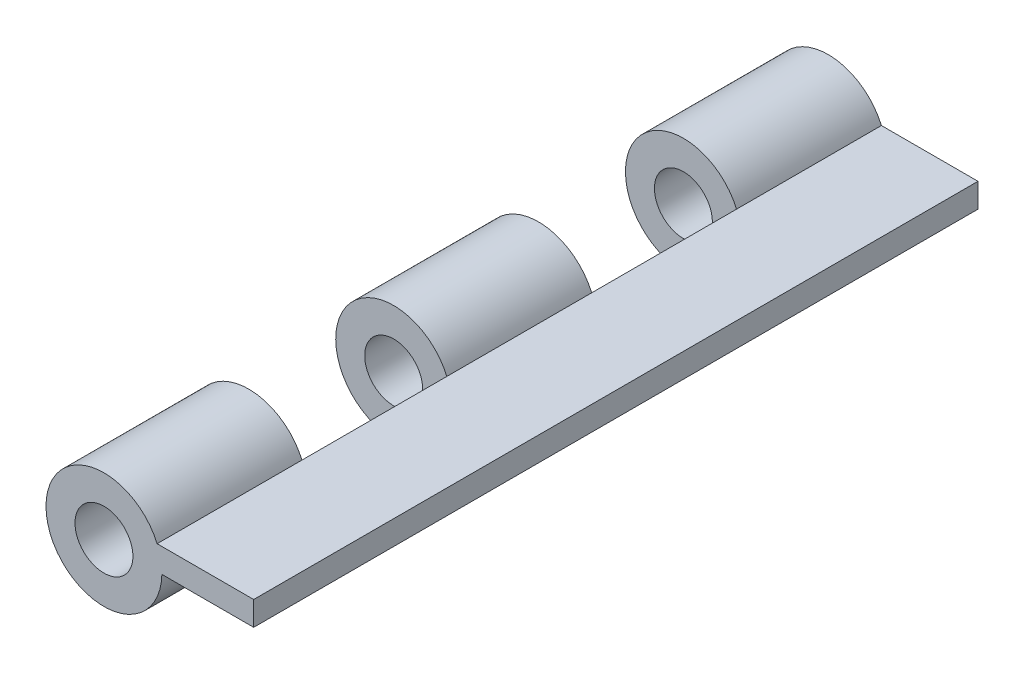
ISO-10303-21;
HEADER;
FILE_DESCRIPTION(('STEP AP214'),'2;1');
FILE_NAME('part.step','',(''),(''),'','','');
FILE_SCHEMA(('AUTOMOTIVE_DESIGN { 1 0 10303 214 1 1 1 1 }'));
ENDSEC;
DATA;
#1=APPLICATION_CONTEXT('core data for automotive mechanical design processes');
#2=APPLICATION_PROTOCOL_DEFINITION('international standard','automotive_design',2000,#1);
#3=PRODUCT_CONTEXT('',#1,'mechanical');
#4=PRODUCT('Part','Part','',(#3));
#5=PRODUCT_RELATED_PRODUCT_CATEGORY('part','',(#4));
#6=PRODUCT_DEFINITION_FORMATION('','',#4);
#7=PRODUCT_DEFINITION_CONTEXT('part definition',#1,'design');
#8=PRODUCT_DEFINITION('design','',#6,#7);
#9=PRODUCT_DEFINITION_SHAPE('','',#8);
#10=(LENGTH_UNIT() NAMED_UNIT(*) SI_UNIT(.MILLI.,.METRE.));
#11=(NAMED_UNIT(*) PLANE_ANGLE_UNIT() SI_UNIT($,.RADIAN.));
#12=(NAMED_UNIT(*) SI_UNIT($,.STERADIAN.) SOLID_ANGLE_UNIT());
#13=UNCERTAINTY_MEASURE_WITH_UNIT(LENGTH_MEASURE(1.E-05),#10,'distance_accuracy_value','');
#14=(GEOMETRIC_REPRESENTATION_CONTEXT(3) GLOBAL_UNCERTAINTY_ASSIGNED_CONTEXT((#13)) GLOBAL_UNIT_ASSIGNED_CONTEXT((#10,
#11,#12)) REPRESENTATION_CONTEXT('',''));
#15=CARTESIAN_POINT('',(0.,0.,0.));
#16=DIRECTION('',(0.,0.,1.));
#17=DIRECTION('',(1.,0.,0.));
#18=AXIS2_PLACEMENT_3D('',#15,#16,#17);
#19=CARTESIAN_POINT('',(-10.,2.5,75.0000000000001));
#20=DIRECTION('',(1.,0.,0.));
#21=DIRECTION('',(0.,0.,-1.));
#22=AXIS2_PLACEMENT_3D('',#19,#20,#21);
#23=PLANE('',#22);
#24=DIRECTION('',(0.,0.,1.));
#25=VECTOR('',#24,1.);
#26=CARTESIAN_POINT('',(-10.,2.5,75.0000000000001));
#27=LINE('',#26,#25);
#28=CARTESIAN_POINT('',(-10.,2.5,-44.9999999999999));
#29=VERTEX_POINT('',#28);
#30=CARTESIAN_POINT('',(-10.,2.5,-14.9999999999999));
#31=VERTEX_POINT('',#30);
#32=EDGE_CURVE('E174',#29,#31,#27,.T.);
#33=ORIENTED_EDGE('',*,*,#32,.F.);
#34=DIRECTION('',(0.,-1.,0.));
#35=VECTOR('',#34,1.);
#36=CARTESIAN_POINT('',(-10.,2.5,-44.9999999999999));
#37=LINE('',#36,#35);
#38=CARTESIAN_POINT('',(-10.,-2.5,-44.9999999999999));
#39=VERTEX_POINT('',#38);
#40=EDGE_CURVE('E117',#29,#39,#37,.T.);
#41=ORIENTED_EDGE('',*,*,#40,.T.);
#42=DIRECTION('',(0.,0.,1.));
#43=VECTOR('',#42,1.);
#44=CARTESIAN_POINT('',(-10.,-2.5,75.0000000000001));
#45=LINE('',#44,#43);
#46=CARTESIAN_POINT('',(-10.,-2.5,-14.9999999999999));
#47=VERTEX_POINT('',#46);
#48=EDGE_CURVE('E129',#39,#47,#45,.T.);
#49=ORIENTED_EDGE('',*,*,#48,.T.);
#50=DIRECTION('',(0.,-1.,0.));
#51=VECTOR('',#50,1.);
#52=CARTESIAN_POINT('',(-10.,2.5,-14.9999999999999));
#53=LINE('',#52,#51);
#54=EDGE_CURVE('E146',#31,#47,#53,.T.);
#55=ORIENTED_EDGE('',*,*,#54,.F.);
#56=EDGE_LOOP('',(#33,#41,#49,#55));
#57=FACE_BOUND('',#56,.T.);
#58=ADVANCED_FACE('F34',(#57),#23,.F.);
#59=CARTESIAN_POINT('',(0.,-2.5,0.));
#60=DIRECTION('',(0.,1.,0.));
#61=DIRECTION('',(0.,0.,1.));
#62=AXIS2_PLACEMENT_3D('',#59,#60,#61);
#63=PLANE('',#62);
#64=DIRECTION('',(1.,0.,0.));
#65=VECTOR('',#64,1.);
#66=CARTESIAN_POINT('',(0.,-2.5,-44.9999999999999));
#67=LINE('',#66,#65);
#68=CARTESIAN_POINT('',(-9.01178484052324,-2.5,-44.9999999999999));
#69=VERTEX_POINT('',#68);
#70=EDGE_CURVE('E121',#39,#69,#67,.T.);
#71=ORIENTED_EDGE('',*,*,#70,.T.);
#72=DIRECTION('',(0.,0.,1.));
#73=VECTOR('',#72,1.);
#74=CARTESIAN_POINT('',(-9.01178484052324,-2.5,-74.9999999999999));
#75=LINE('',#74,#73);
#76=CARTESIAN_POINT('',(-9.01178484052324,-2.5,-74.9999999999999));
#77=VERTEX_POINT('',#76);
#78=EDGE_CURVE('E108',#69,#77,#75,.F.);
#79=ORIENTED_EDGE('',*,*,#78,.T.);
#80=DIRECTION('',(-1.,0.,0.));
#81=VECTOR('',#80,1.);
#82=CARTESIAN_POINT('',(10.,-2.5,-74.9999999999999));
#83=LINE('',#82,#81);
#84=CARTESIAN_POINT('',(10.,-2.5,-74.9999999999999));
#85=VERTEX_POINT('',#84);
#86=EDGE_CURVE('E188',#85,#77,#83,.T.);
#87=ORIENTED_EDGE('',*,*,#86,.F.);
#88=DIRECTION('',(0.,0.,-1.));
#89=VECTOR('',#88,1.);
#90=CARTESIAN_POINT('',(10.,-2.5,75.0000000000001));
#91=LINE('',#90,#89);
#92=CARTESIAN_POINT('',(10.,-2.5,75.0000000000001));
#93=VERTEX_POINT('',#92);
#94=EDGE_CURVE('E186',#93,#85,#91,.T.);
#95=ORIENTED_EDGE('',*,*,#94,.F.);
#96=DIRECTION('',(1.,0.,0.));
#97=VECTOR('',#96,1.);
#98=CARTESIAN_POINT('',(10.,-2.5,75.0000000000001));
#99=LINE('',#98,#97);
#100=CARTESIAN_POINT('',(-9.01178484052324,-2.5,75.0000000000001));
#101=VERTEX_POINT('',#100);
#102=EDGE_CURVE('E184',#101,#93,#99,.T.);
#103=ORIENTED_EDGE('',*,*,#102,.F.);
#104=DIRECTION('',(0.,0.,1.));
#105=VECTOR('',#104,1.);
#106=CARTESIAN_POINT('',(-9.01178484052324,-2.5,45.0000000000001));
#107=LINE('',#106,#105);
#108=CARTESIAN_POINT('',(-9.01178484052324,-2.5,45.0000000000001));
#109=VERTEX_POINT('',#108);
#110=EDGE_CURVE('E197',#101,#109,#107,.F.);
#111=ORIENTED_EDGE('',*,*,#110,.T.);
#112=DIRECTION('',(1.,0.,0.));
#113=VECTOR('',#112,1.);
#114=CARTESIAN_POINT('',(0.,-2.5,45.0000000000001));
#115=LINE('',#114,#113);
#116=CARTESIAN_POINT('',(-10.,-2.5,45.0000000000001));
#117=VERTEX_POINT('',#116);
#118=EDGE_CURVE('E195',#117,#109,#115,.T.);
#119=ORIENTED_EDGE('',*,*,#118,.F.);
#120=CARTESIAN_POINT('',(-10.,-2.5,15.0000000000001));
#121=VERTEX_POINT('',#120);
#122=EDGE_CURVE('E169',#121,#117,#45,.T.);
#123=ORIENTED_EDGE('',*,*,#122,.F.);
#124=DIRECTION('',(1.,0.,0.));
#125=VECTOR('',#124,1.);
#126=CARTESIAN_POINT('',(0.,-2.5,15.0000000000001));
#127=LINE('',#126,#125);
#128=CARTESIAN_POINT('',(-9.01178484052324,-2.5,15.0000000000001));
#129=VERTEX_POINT('',#128);
#130=EDGE_CURVE('E200',#121,#129,#127,.T.);
#131=ORIENTED_EDGE('',*,*,#130,.T.);
#132=DIRECTION('',(0.,0.,1.));
#133=VECTOR('',#132,1.);
#134=CARTESIAN_POINT('',(-9.01178484052324,-2.5,-14.9999999999999));
#135=LINE('',#134,#133);
#136=CARTESIAN_POINT('',(-9.01178484052324,-2.5,-14.9999999999999));
#137=VERTEX_POINT('',#136);
#138=EDGE_CURVE('E42',#129,#137,#135,.F.);
#139=ORIENTED_EDGE('',*,*,#138,.T.);
#140=DIRECTION('',(1.,0.,0.));
#141=VECTOR('',#140,1.);
#142=CARTESIAN_POINT('',(0.,-2.5,-14.9999999999999));
#143=LINE('',#142,#141);
#144=EDGE_CURVE('E11',#47,#137,#143,.T.);
#145=ORIENTED_EDGE('',*,*,#144,.F.);
#146=ORIENTED_EDGE('',*,*,#48,.F.);
#147=EDGE_LOOP('',(#71,#79,#87,#95,#103,#111,#119,#123,#131,#139,#145,#146));
#148=FACE_BOUND('',#147,.T.);
#149=ADVANCED_FACE('F127',(#148),#63,.F.);
#150=CARTESIAN_POINT('',(-10.,2.5,15.0000000000001));
#151=VERTEX_POINT('',#150);
#152=CARTESIAN_POINT('',(-10.,2.5,45.0000000000001));
#153=VERTEX_POINT('',#152);
#154=EDGE_CURVE('E175',#151,#153,#27,.T.);
#155=ORIENTED_EDGE('',*,*,#154,.F.);
#156=DIRECTION('',(0.,-1.,0.));
#157=VECTOR('',#156,1.);
#158=CARTESIAN_POINT('',(-10.,2.5,15.0000000000001));
#159=LINE('',#158,#157);
#160=EDGE_CURVE('E142',#151,#121,#159,.T.);
#161=ORIENTED_EDGE('',*,*,#160,.T.);
#162=ORIENTED_EDGE('',*,*,#122,.T.);
#163=DIRECTION('',(0.,-1.,0.));
#164=VECTOR('',#163,1.);
#165=CARTESIAN_POINT('',(-10.,2.5,45.0000000000001));
#166=LINE('',#165,#164);
#167=EDGE_CURVE('E162',#153,#117,#166,.T.);
#168=ORIENTED_EDGE('',*,*,#167,.F.);
#169=EDGE_LOOP('',(#155,#161,#162,#168));
#170=FACE_BOUND('',#169,.T.);
#171=ADVANCED_FACE('F36',(#170),#23,.F.);
#172=CARTESIAN_POINT('',(10.,2.5,75.0000000000001));
#173=DIRECTION('',(0.,0.,-1.));
#174=DIRECTION('',(-1.,0.,0.));
#175=AXIS2_PLACEMENT_3D('',#172,#173,#174);
#176=PLANE('',#175);
#177=DIRECTION('',(1.,0.,0.));
#178=VECTOR('',#177,1.);
#179=CARTESIAN_POINT('',(10.,2.5,75.0000000000001));
#180=LINE('',#179,#178);
#181=CARTESIAN_POINT('',(-10.,2.5,75.0000000000001));
#182=VERTEX_POINT('',#181);
#183=CARTESIAN_POINT('',(10.,2.5,75.0000000000001));
#184=VERTEX_POINT('',#183);
#185=EDGE_CURVE('E173',#182,#184,#180,.T.);
#186=ORIENTED_EDGE('',*,*,#185,.F.);
#187=CARTESIAN_POINT('',(-21.0096496505304,-2.2736374571784,75.0000000000001));
#188=DIRECTION('',(0.,0.,1.));
#189=DIRECTION('',(1.,0.,0.));
#190=AXIS2_PLACEMENT_3D('',#187,#188,#189);
#191=CIRCLE('',#190,12.);
#192=EDGE_CURVE('E156',#182,#101,#191,.T.);
#193=ORIENTED_EDGE('',*,*,#192,.T.);
#194=ORIENTED_EDGE('',*,*,#102,.T.);
#195=DIRECTION('',(0.,-1.,0.));
#196=VECTOR('',#195,1.);
#197=CARTESIAN_POINT('',(10.,2.5,75.0000000000001));
#198=LINE('',#197,#196);
#199=EDGE_CURVE('E192',#184,#93,#198,.T.);
#200=ORIENTED_EDGE('',*,*,#199,.F.);
#201=EDGE_LOOP('',(#186,#193,#194,#200));
#202=FACE_BOUND('',#201,.T.);
#203=CARTESIAN_POINT('',(-21.0096496505304,-2.2736374571784,75.0000000000001));
#204=DIRECTION('',(0.,0.,1.));
#205=DIRECTION('',(1.,0.,0.));
#206=AXIS2_PLACEMENT_3D('',#203,#204,#205);
#207=CIRCLE('',#206,6.);
#208=CARTESIAN_POINT('',(-15.0096496505304,-2.2736374571784,75.0000000000001));
#209=VERTEX_POINT('',#208);
#210=EDGE_CURVE('E152',#209,#209,#207,.T.);
#211=ORIENTED_EDGE('',*,*,#210,.F.);
#212=EDGE_LOOP('',(#211));
#213=FACE_BOUND('',#212,.T.);
#214=ADVANCED_FACE('F228',(#202,#213),#176,.F.);
#215=CARTESIAN_POINT('',(10.,2.5,75.0000000000001));
#216=DIRECTION('',(-1.,0.,0.));
#217=DIRECTION('',(0.,0.,1.));
#218=AXIS2_PLACEMENT_3D('',#215,#216,#217);
#219=PLANE('',#218);
#220=ORIENTED_EDGE('',*,*,#94,.T.);
#221=DIRECTION('',(0.,-1.,0.));
#222=VECTOR('',#221,1.);
#223=CARTESIAN_POINT('',(10.,2.5,-74.9999999999999));
#224=LINE('',#223,#222);
#225=CARTESIAN_POINT('',(10.,2.5,-74.9999999999999));
#226=VERTEX_POINT('',#225);
#227=EDGE_CURVE('E182',#226,#85,#224,.T.);
#228=ORIENTED_EDGE('',*,*,#227,.F.);
#229=DIRECTION('',(0.,0.,-1.));
#230=VECTOR('',#229,1.);
#231=CARTESIAN_POINT('',(10.,2.5,75.0000000000001));
#232=LINE('',#231,#230);
#233=EDGE_CURVE('E177',#184,#226,#232,.T.);
#234=ORIENTED_EDGE('',*,*,#233,.F.);
#235=ORIENTED_EDGE('',*,*,#199,.T.);
#236=EDGE_LOOP('',(#220,#228,#234,#235));
#237=FACE_BOUND('',#236,.T.);
#238=ADVANCED_FACE('F223',(#237),#219,.F.);
#239=CARTESIAN_POINT('',(10.,2.5,-74.9999999999999));
#240=DIRECTION('',(0.,0.,1.));
#241=DIRECTION('',(1.,0.,0.));
#242=AXIS2_PLACEMENT_3D('',#239,#240,#241);
#243=PLANE('',#242);
#244=ORIENTED_EDGE('',*,*,#86,.T.);
#245=CARTESIAN_POINT('',(-21.0096496505304,-2.2736374571784,-74.9999999999999));
#246=DIRECTION('',(0.,0.,1.));
#247=DIRECTION('',(1.,0.,0.));
#248=AXIS2_PLACEMENT_3D('',#245,#246,#247);
#249=CIRCLE('',#248,12.);
#250=CARTESIAN_POINT('',(-10.,2.5,-74.9999999999999));
#251=VERTEX_POINT('',#250);
#252=EDGE_CURVE('E111',#251,#77,#249,.T.);
#253=ORIENTED_EDGE('',*,*,#252,.F.);
#254=DIRECTION('',(-1.,0.,0.));
#255=VECTOR('',#254,1.);
#256=CARTESIAN_POINT('',(10.,2.5,-74.9999999999999));
#257=LINE('',#256,#255);
#258=EDGE_CURVE('E179',#226,#251,#257,.T.);
#259=ORIENTED_EDGE('',*,*,#258,.F.);
#260=ORIENTED_EDGE('',*,*,#227,.T.);
#261=EDGE_LOOP('',(#244,#253,#259,#260));
#262=FACE_BOUND('',#261,.T.);
#263=CARTESIAN_POINT('',(-21.0096496505304,-2.2736374571784,-74.9999999999999));
#264=DIRECTION('',(0.,0.,1.));
#265=DIRECTION('',(1.,0.,0.));
#266=AXIS2_PLACEMENT_3D('',#263,#264,#265);
#267=CIRCLE('',#266,6.);
#268=CARTESIAN_POINT('',(-15.0096496505304,-2.2736374571784,-74.9999999999999));
#269=VERTEX_POINT('',#268);
#270=EDGE_CURVE('E124',#269,#269,#267,.T.);
#271=ORIENTED_EDGE('',*,*,#270,.T.);
#272=EDGE_LOOP('',(#271));
#273=FACE_BOUND('',#272,.T.);
#274=ADVANCED_FACE('F217',(#262,#273),#243,.F.);
#275=CARTESIAN_POINT('',(0.,2.5,0.));
#276=DIRECTION('',(0.,1.,0.));
#277=DIRECTION('',(0.,0.,1.));
#278=AXIS2_PLACEMENT_3D('',#275,#276,#277);
#279=PLANE('',#278);
#280=EDGE_CURVE('E170',#251,#29,#27,.T.);
#281=ORIENTED_EDGE('',*,*,#280,.T.);
#282=ORIENTED_EDGE('',*,*,#32,.T.);
#283=DIRECTION('',(0.,0.,1.));
#284=VECTOR('',#283,1.);
#285=CARTESIAN_POINT('',(-10.,2.5,-14.9999999999999));
#286=LINE('',#285,#284);
#287=EDGE_CURVE('E149',#151,#31,#286,.F.);
#288=ORIENTED_EDGE('',*,*,#287,.F.);
#289=ORIENTED_EDGE('',*,*,#154,.T.);
#290=DIRECTION('',(0.,0.,1.));
#291=VECTOR('',#290,1.);
#292=CARTESIAN_POINT('',(-10.,2.5,45.0000000000001));
#293=LINE('',#292,#291);
#294=EDGE_CURVE('E166',#182,#153,#293,.F.);
#295=ORIENTED_EDGE('',*,*,#294,.F.);
#296=ORIENTED_EDGE('',*,*,#185,.T.);
#297=ORIENTED_EDGE('',*,*,#233,.T.);
#298=ORIENTED_EDGE('',*,*,#258,.T.);
#299=EDGE_LOOP('',(#281,#282,#288,#289,#295,#296,#297,#298));
#300=FACE_BOUND('',#299,.T.);
#301=ADVANCED_FACE('F214',(#300),#279,.T.);
#302=CARTESIAN_POINT('',(-21.0096496505304,-2.2736374571784,45.0000000000001));
#303=DIRECTION('',(0.,0.,1.));
#304=DIRECTION('',(1.,0.,0.));
#305=AXIS2_PLACEMENT_3D('',#302,#303,#304);
#306=PLANE('',#305);
#307=CARTESIAN_POINT('',(-21.0096496505304,-2.2736374571784,45.0000000000001));
#308=DIRECTION('',(0.,0.,1.));
#309=DIRECTION('',(1.,0.,0.));
#310=AXIS2_PLACEMENT_3D('',#307,#308,#309);
#311=CIRCLE('',#310,6.);
#312=CARTESIAN_POINT('',(-15.0096496505304,-2.2736374571784,45.0000000000001));
#313=VERTEX_POINT('',#312);
#314=EDGE_CURVE('E153',#313,#313,#311,.T.);
#315=ORIENTED_EDGE('',*,*,#314,.T.);
#316=EDGE_LOOP('',(#315));
#317=FACE_BOUND('',#316,.T.);
#318=CARTESIAN_POINT('',(-21.0096496505304,-2.2736374571784,45.0000000000001));
#319=DIRECTION('',(0.,0.,1.));
#320=DIRECTION('',(1.,0.,0.));
#321=AXIS2_PLACEMENT_3D('',#318,#319,#320);
#322=CIRCLE('',#321,12.);
#323=EDGE_CURVE('E159',#153,#109,#322,.T.);
#324=ORIENTED_EDGE('',*,*,#323,.F.);
#325=ORIENTED_EDGE('',*,*,#167,.T.);
#326=ORIENTED_EDGE('',*,*,#118,.T.);
#327=EDGE_LOOP('',(#324,#325,#326));
#328=FACE_BOUND('',#327,.T.);
#329=ADVANCED_FACE('F237',(#317,#328),#306,.F.);
#330=CARTESIAN_POINT('',(-21.0096496505304,-2.2736374571784,45.0000000000001));
#331=DIRECTION('',(0.,0.,1.));
#332=DIRECTION('',(1.,0.,0.));
#333=AXIS2_PLACEMENT_3D('',#330,#331,#332);
#334=CYLINDRICAL_SURFACE('',#333,12.);
#335=ORIENTED_EDGE('',*,*,#192,.F.);
#336=ORIENTED_EDGE('',*,*,#294,.T.);
#337=ORIENTED_EDGE('',*,*,#323,.T.);
#338=ORIENTED_EDGE('',*,*,#110,.F.);
#339=EDGE_LOOP('',(#335,#336,#337,#338));
#340=FACE_BOUND('',#339,.T.);
#341=ADVANCED_FACE('F233',(#340),#334,.T.);
#342=CARTESIAN_POINT('',(-21.0096496505304,-2.2736374571784,45.0000000000001));
#343=DIRECTION('',(0.,0.,1.));
#344=DIRECTION('',(1.,0.,0.));
#345=AXIS2_PLACEMENT_3D('',#342,#343,#344);
#346=CYLINDRICAL_SURFACE('',#345,6.);
#347=ORIENTED_EDGE('',*,*,#314,.F.);
#348=EDGE_LOOP('',(#347));
#349=FACE_BOUND('',#348,.T.);
#350=ORIENTED_EDGE('',*,*,#210,.T.);
#351=EDGE_LOOP('',(#350));
#352=FACE_BOUND('',#351,.T.);
#353=ADVANCED_FACE('F250',(#349,#352),#346,.F.);
#354=CARTESIAN_POINT('',(-21.0096496505304,-2.2736374571784,-14.9999999999999));
#355=DIRECTION('',(0.,0.,1.));
#356=DIRECTION('',(1.,0.,0.));
#357=AXIS2_PLACEMENT_3D('',#354,#355,#356);
#358=PLANE('',#357);
#359=CARTESIAN_POINT('',(-21.0096496505304,-2.2736374571784,-14.9999999999999));
#360=DIRECTION('',(0.,0.,1.));
#361=DIRECTION('',(1.,0.,0.));
#362=AXIS2_PLACEMENT_3D('',#359,#360,#361);
#363=CIRCLE('',#362,6.);
#364=CARTESIAN_POINT('',(-15.0096496505304,-2.2736374571784,-14.9999999999999));
#365=VERTEX_POINT('',#364);
#366=EDGE_CURVE('E134',#365,#365,#363,.T.);
#367=ORIENTED_EDGE('',*,*,#366,.T.);
#368=EDGE_LOOP('',(#367));
#369=FACE_BOUND('',#368,.T.);
#370=CARTESIAN_POINT('',(-21.0096496505304,-2.2736374571784,-14.9999999999999));
#371=DIRECTION('',(0.,0.,1.));
#372=DIRECTION('',(1.,0.,0.));
#373=AXIS2_PLACEMENT_3D('',#370,#371,#372);
#374=CIRCLE('',#373,12.);
#375=EDGE_CURVE('E139',#31,#137,#374,.T.);
#376=ORIENTED_EDGE('',*,*,#375,.F.);
#377=ORIENTED_EDGE('',*,*,#54,.T.);
#378=ORIENTED_EDGE('',*,*,#144,.T.);
#379=EDGE_LOOP('',(#376,#377,#378));
#380=FACE_BOUND('',#379,.T.);
#381=ADVANCED_FACE('F211',(#369,#380),#358,.F.);
#382=CARTESIAN_POINT('',(-21.0096496505304,-2.2736374571784,15.0000000000001));
#383=DIRECTION('',(0.,0.,1.));
#384=DIRECTION('',(1.,0.,0.));
#385=AXIS2_PLACEMENT_3D('',#382,#383,#384);
#386=PLANE('',#385);
#387=CARTESIAN_POINT('',(-21.0096496505304,-2.2736374571784,15.0000000000001));
#388=DIRECTION('',(0.,0.,1.));
#389=DIRECTION('',(1.,0.,0.));
#390=AXIS2_PLACEMENT_3D('',#387,#388,#389);
#391=CIRCLE('',#390,6.);
#392=CARTESIAN_POINT('',(-15.0096496505304,-2.2736374571784,15.0000000000001));
#393=VERTEX_POINT('',#392);
#394=EDGE_CURVE('E116',#393,#393,#391,.T.);
#395=ORIENTED_EDGE('',*,*,#394,.F.);
#396=EDGE_LOOP('',(#395));
#397=FACE_BOUND('',#396,.T.);
#398=ORIENTED_EDGE('',*,*,#160,.F.);
#399=CARTESIAN_POINT('',(-21.0096496505304,-2.2736374571784,15.0000000000001));
#400=DIRECTION('',(0.,0.,1.));
#401=DIRECTION('',(1.,0.,0.));
#402=AXIS2_PLACEMENT_3D('',#399,#400,#401);
#403=CIRCLE('',#402,12.);
#404=EDGE_CURVE('E57',#151,#129,#403,.T.);
#405=ORIENTED_EDGE('',*,*,#404,.T.);
#406=ORIENTED_EDGE('',*,*,#130,.F.);
#407=EDGE_LOOP('',(#398,#405,#406));
#408=FACE_BOUND('',#407,.T.);
#409=ADVANCED_FACE('F240',(#397,#408),#386,.T.);
#410=CARTESIAN_POINT('',(-21.0096496505304,-2.2736374571784,-14.9999999999999));
#411=DIRECTION('',(0.,0.,1.));
#412=DIRECTION('',(1.,0.,0.));
#413=AXIS2_PLACEMENT_3D('',#410,#411,#412);
#414=CYLINDRICAL_SURFACE('',#413,12.);
#415=ORIENTED_EDGE('',*,*,#404,.F.);
#416=ORIENTED_EDGE('',*,*,#287,.T.);
#417=ORIENTED_EDGE('',*,*,#375,.T.);
#418=ORIENTED_EDGE('',*,*,#138,.F.);
#419=EDGE_LOOP('',(#415,#416,#417,#418));
#420=FACE_BOUND('',#419,.T.);
#421=ADVANCED_FACE('F205',(#420),#414,.T.);
#422=CARTESIAN_POINT('',(-21.0096496505304,-2.2736374571784,-14.9999999999999));
#423=DIRECTION('',(0.,0.,1.));
#424=DIRECTION('',(1.,0.,0.));
#425=AXIS2_PLACEMENT_3D('',#422,#423,#424);
#426=CYLINDRICAL_SURFACE('',#425,6.);
#427=ORIENTED_EDGE('',*,*,#366,.F.);
#428=EDGE_LOOP('',(#427));
#429=FACE_BOUND('',#428,.T.);
#430=ORIENTED_EDGE('',*,*,#394,.T.);
#431=EDGE_LOOP('',(#430));
#432=FACE_BOUND('',#431,.T.);
#433=ADVANCED_FACE('F248',(#429,#432),#426,.F.);
#434=CARTESIAN_POINT('',(-21.0096496505304,-2.2736374571784,-74.9999999999999));
#435=DIRECTION('',(0.,0.,1.));
#436=DIRECTION('',(1.,0.,0.));
#437=AXIS2_PLACEMENT_3D('',#434,#435,#436);
#438=CYLINDRICAL_SURFACE('',#437,12.);
#439=ORIENTED_EDGE('',*,*,#78,.F.);
#440=CARTESIAN_POINT('',(-21.0096496505304,-2.2736374571784,-44.9999999999999));
#441=DIRECTION('',(0.,0.,1.));
#442=DIRECTION('',(1.,0.,0.));
#443=AXIS2_PLACEMENT_3D('',#440,#441,#442);
#444=CIRCLE('',#443,12.);
#445=EDGE_CURVE('E49',#29,#69,#444,.T.);
#446=ORIENTED_EDGE('',*,*,#445,.F.);
#447=ORIENTED_EDGE('',*,*,#280,.F.);
#448=ORIENTED_EDGE('',*,*,#252,.T.);
#449=EDGE_LOOP('',(#439,#446,#447,#448));
#450=FACE_BOUND('',#449,.T.);
#451=ADVANCED_FACE('F109',(#450),#438,.T.);
#452=CARTESIAN_POINT('',(-21.0096496505304,-2.2736374571784,-44.9999999999999));
#453=DIRECTION('',(0.,0.,1.));
#454=DIRECTION('',(1.,0.,0.));
#455=AXIS2_PLACEMENT_3D('',#452,#453,#454);
#456=PLANE('',#455);
#457=CARTESIAN_POINT('',(-21.0096496505304,-2.2736374571784,-44.9999999999999));
#458=DIRECTION('',(0.,0.,1.));
#459=DIRECTION('',(1.,0.,0.));
#460=AXIS2_PLACEMENT_3D('',#457,#458,#459);
#461=CIRCLE('',#460,6.);
#462=CARTESIAN_POINT('',(-15.0096496505304,-2.2736374571784,-44.9999999999999));
#463=VERTEX_POINT('',#462);
#464=EDGE_CURVE('E350',#463,#463,#461,.T.);
#465=ORIENTED_EDGE('',*,*,#464,.F.);
#466=EDGE_LOOP('',(#465));
#467=FACE_BOUND('',#466,.T.);
#468=ORIENTED_EDGE('',*,*,#40,.F.);
#469=ORIENTED_EDGE('',*,*,#445,.T.);
#470=ORIENTED_EDGE('',*,*,#70,.F.);
#471=EDGE_LOOP('',(#468,#469,#470));
#472=FACE_BOUND('',#471,.T.);
#473=ADVANCED_FACE('F120',(#467,#472),#456,.T.);
#474=CARTESIAN_POINT('',(-21.0096496505304,-2.2736374571784,-74.9999999999999));
#475=DIRECTION('',(0.,0.,1.));
#476=DIRECTION('',(1.,0.,0.));
#477=AXIS2_PLACEMENT_3D('',#474,#475,#476);
#478=CYLINDRICAL_SURFACE('',#477,6.);
#479=ORIENTED_EDGE('',*,*,#270,.F.);
#480=EDGE_LOOP('',(#479));
#481=FACE_BOUND('',#480,.T.);
#482=ORIENTED_EDGE('',*,*,#464,.T.);
#483=EDGE_LOOP('',(#482));
#484=FACE_BOUND('',#483,.T.);
#485=ADVANCED_FACE('F331',(#481,#484),#478,.F.);
#486=CLOSED_SHELL('',(#58,#149,#171,#214,#238,#274,#301,#329,#341,#353,#381,#409,#421,#433,#451,
#473,#485));
#487=MANIFOLD_SOLID_BREP('B2',#486);
#488=ADVANCED_BREP_SHAPE_REPRESENTATION('',(#18,#487),#14);
#489=SHAPE_DEFINITION_REPRESENTATION(#9,#488);
ENDSEC;
END-ISO-10303-21;
